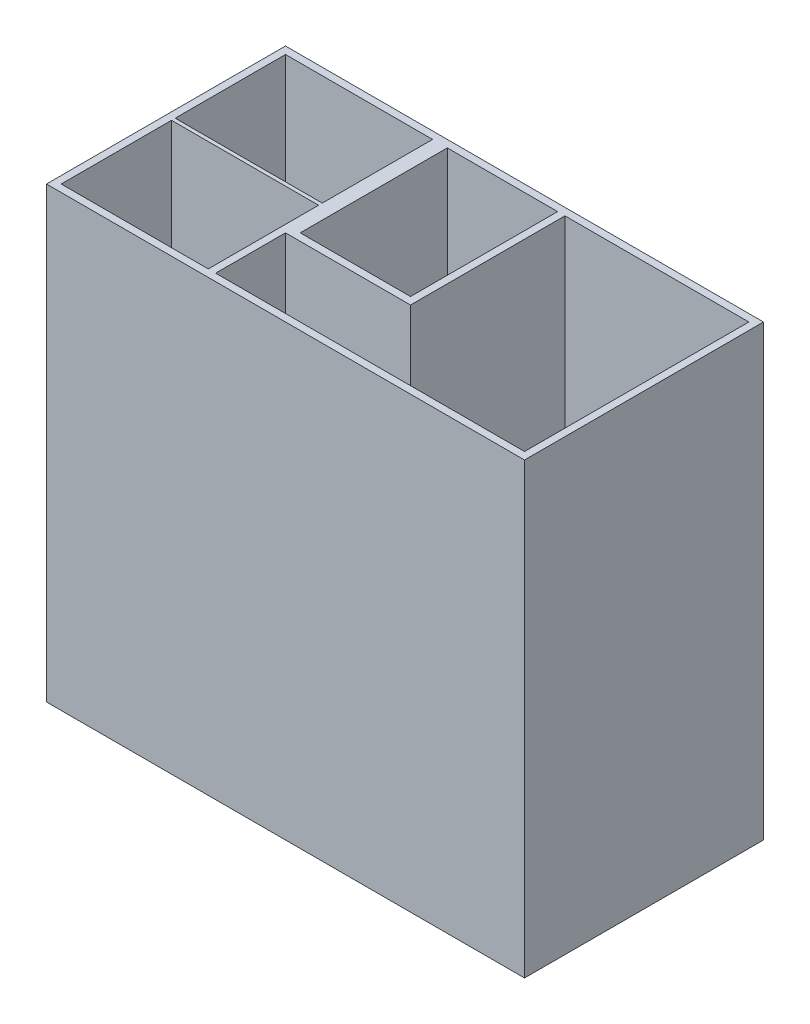
ISO-10303-21;
HEADER;
FILE_DESCRIPTION(('STEP AP214'),'2;1');
FILE_NAME('part.step','',(''),(''),'','','');
FILE_SCHEMA(('AUTOMOTIVE_DESIGN { 1 0 10303 214 1 1 1 1 }'));
ENDSEC;
DATA;
#1=APPLICATION_CONTEXT('core data for automotive mechanical design processes');
#2=APPLICATION_PROTOCOL_DEFINITION('international standard','automotive_design',2000,#1);
#3=PRODUCT_CONTEXT('',#1,'mechanical');
#4=PRODUCT('Part','Part','',(#3));
#5=PRODUCT_RELATED_PRODUCT_CATEGORY('part','',(#4));
#6=PRODUCT_DEFINITION_FORMATION('','',#4);
#7=PRODUCT_DEFINITION_CONTEXT('part definition',#1,'design');
#8=PRODUCT_DEFINITION('design','',#6,#7);
#9=PRODUCT_DEFINITION_SHAPE('','',#8);
#10=(LENGTH_UNIT() NAMED_UNIT(*) SI_UNIT(.MILLI.,.METRE.));
#11=(NAMED_UNIT(*) PLANE_ANGLE_UNIT() SI_UNIT($,.RADIAN.));
#12=(NAMED_UNIT(*) SI_UNIT($,.STERADIAN.) SOLID_ANGLE_UNIT());
#13=UNCERTAINTY_MEASURE_WITH_UNIT(LENGTH_MEASURE(1.E-05),#10,'distance_accuracy_value','');
#14=(GEOMETRIC_REPRESENTATION_CONTEXT(3) GLOBAL_UNCERTAINTY_ASSIGNED_CONTEXT((#13)) GLOBAL_UNIT_ASSIGNED_CONTEXT((#10,
#11,#12)) REPRESENTATION_CONTEXT('',''));
#15=CARTESIAN_POINT('',(0.,0.,0.));
#16=DIRECTION('',(0.,0.,1.));
#17=DIRECTION('',(1.,0.,0.));
#18=AXIS2_PLACEMENT_3D('',#15,#16,#17);
#19=CARTESIAN_POINT('',(-63.,122.,-30.5));
#20=DIRECTION('',(0.,0.,1.));
#21=DIRECTION('',(1.,0.,0.));
#22=AXIS2_PLACEMENT_3D('',#19,#20,#21);
#23=PLANE('',#22);
#24=DIRECTION('',(-1.,0.,0.));
#25=VECTOR('',#24,1.);
#26=CARTESIAN_POINT('',(-63.,2.,-30.5));
#27=LINE('',#26,#25);
#28=CARTESIAN_POINT('',(-23.,2.,-30.5));
#29=VERTEX_POINT('',#28);
#30=CARTESIAN_POINT('',(-63.,2.,-30.5));
#31=VERTEX_POINT('',#30);
#32=EDGE_CURVE('E295',#29,#31,#27,.T.);
#33=ORIENTED_EDGE('',*,*,#32,.F.);
#34=DIRECTION('',(0.,-1.,0.));
#35=VECTOR('',#34,1.);
#36=CARTESIAN_POINT('',(-23.,122.,-30.5));
#37=LINE('',#36,#35);
#38=CARTESIAN_POINT('',(-23.,122.,-30.5));
#39=VERTEX_POINT('',#38);
#40=EDGE_CURVE('E48',#39,#29,#37,.T.);
#41=ORIENTED_EDGE('',*,*,#40,.F.);
#42=DIRECTION('',(-1.,0.,0.));
#43=VECTOR('',#42,1.);
#44=CARTESIAN_POINT('',(-63.,122.,-30.5));
#45=LINE('',#44,#43);
#46=CARTESIAN_POINT('',(-63.,122.,-30.5));
#47=VERTEX_POINT('',#46);
#48=EDGE_CURVE('E191',#39,#47,#45,.T.);
#49=ORIENTED_EDGE('',*,*,#48,.T.);
#50=DIRECTION('',(0.,-1.,0.));
#51=VECTOR('',#50,1.);
#52=CARTESIAN_POINT('',(-63.,122.,-30.5));
#53=LINE('',#52,#51);
#54=EDGE_CURVE('E312',#47,#31,#53,.T.);
#55=ORIENTED_EDGE('',*,*,#54,.T.);
#56=EDGE_LOOP('',(#33,#41,#49,#55));
#57=FACE_BOUND('',#56,.T.);
#58=ADVANCED_FACE('F33',(#57),#23,.T.);
#59=DIRECTION('',(0.,-1.,0.));
#60=VECTOR('',#59,1.);
#61=CARTESIAN_POINT('',(-19.,122.,-30.5));
#62=LINE('',#61,#60);
#63=CARTESIAN_POINT('',(-19.,122.,-30.5));
#64=VERTEX_POINT('',#63);
#65=CARTESIAN_POINT('',(-19.,2.,-30.5));
#66=VERTEX_POINT('',#65);
#67=EDGE_CURVE('E279',#64,#66,#62,.T.);
#68=ORIENTED_EDGE('',*,*,#67,.T.);
#69=CARTESIAN_POINT('',(11.,2.,-30.5));
#70=VERTEX_POINT('',#69);
#71=EDGE_CURVE('E300',#70,#66,#27,.T.);
#72=ORIENTED_EDGE('',*,*,#71,.F.);
#73=DIRECTION('',(0.,-1.,0.));
#74=VECTOR('',#73,1.);
#75=CARTESIAN_POINT('',(11.,122.,-30.5));
#76=LINE('',#75,#74);
#77=CARTESIAN_POINT('',(11.,122.,-30.5));
#78=VERTEX_POINT('',#77);
#79=EDGE_CURVE('E255',#78,#70,#76,.T.);
#80=ORIENTED_EDGE('',*,*,#79,.F.);
#81=EDGE_CURVE('E56',#78,#64,#45,.T.);
#82=ORIENTED_EDGE('',*,*,#81,.T.);
#83=EDGE_LOOP('',(#68,#72,#80,#82));
#84=FACE_BOUND('',#83,.T.);
#85=ADVANCED_FACE('F371',(#84),#23,.T.);
#86=CARTESIAN_POINT('',(-63.,122.,-30.5));
#87=DIRECTION('',(1.,0.,0.));
#88=DIRECTION('',(0.,0.,-1.));
#89=AXIS2_PLACEMENT_3D('',#86,#87,#88);
#90=PLANE('',#89);
#91=DIRECTION('',(0.,0.,1.));
#92=VECTOR('',#91,1.);
#93=CARTESIAN_POINT('',(-63.,122.,-30.5));
#94=LINE('',#93,#92);
#95=CARTESIAN_POINT('',(-63.,122.,-0.49999999999998));
#96=VERTEX_POINT('',#95);
#97=EDGE_CURVE('E288',#47,#96,#94,.T.);
#98=ORIENTED_EDGE('',*,*,#97,.T.);
#99=DIRECTION('',(0.,-1.,0.));
#100=VECTOR('',#99,1.);
#101=CARTESIAN_POINT('',(-63.,122.,-0.499999999999982));
#102=LINE('',#101,#100);
#103=CARTESIAN_POINT('',(-63.,2.,-0.499999999999983));
#104=VERTEX_POINT('',#103);
#105=EDGE_CURVE('E202',#96,#104,#102,.T.);
#106=ORIENTED_EDGE('',*,*,#105,.T.);
#107=DIRECTION('',(0.,0.,1.));
#108=VECTOR('',#107,1.);
#109=CARTESIAN_POINT('',(-63.,2.,-30.5));
#110=LINE('',#109,#108);
#111=EDGE_CURVE('E301',#31,#104,#110,.T.);
#112=ORIENTED_EDGE('',*,*,#111,.F.);
#113=ORIENTED_EDGE('',*,*,#54,.F.);
#114=EDGE_LOOP('',(#98,#106,#112,#113));
#115=FACE_BOUND('',#114,.T.);
#116=ADVANCED_FACE('F377',(#115),#90,.T.);
#117=CARTESIAN_POINT('',(-63.,122.,30.5));
#118=DIRECTION('',(0.,0.,-1.));
#119=DIRECTION('',(-1.,0.,0.));
#120=AXIS2_PLACEMENT_3D('',#117,#118,#119);
#121=PLANE('',#120);
#122=DIRECTION('',(1.,0.,0.));
#123=VECTOR('',#122,1.);
#124=CARTESIAN_POINT('',(-63.,122.,30.5));
#125=LINE('',#124,#123);
#126=CARTESIAN_POINT('',(-63.,122.,30.5));
#127=VERTEX_POINT('',#126);
#128=CARTESIAN_POINT('',(-23.,122.,30.5));
#129=VERTEX_POINT('',#128);
#130=EDGE_CURVE('E291',#127,#129,#125,.T.);
#131=ORIENTED_EDGE('',*,*,#130,.T.);
#132=DIRECTION('',(0.,-1.,0.));
#133=VECTOR('',#132,1.);
#134=CARTESIAN_POINT('',(-23.,122.,30.5));
#135=LINE('',#134,#133);
#136=CARTESIAN_POINT('',(-23.,2.,30.5));
#137=VERTEX_POINT('',#136);
#138=EDGE_CURVE('E269',#129,#137,#135,.T.);
#139=ORIENTED_EDGE('',*,*,#138,.T.);
#140=DIRECTION('',(1.,0.,0.));
#141=VECTOR('',#140,1.);
#142=CARTESIAN_POINT('',(-63.,2.,30.5));
#143=LINE('',#142,#141);
#144=CARTESIAN_POINT('',(-63.,2.,30.5));
#145=VERTEX_POINT('',#144);
#146=EDGE_CURVE('E284',#145,#137,#143,.T.);
#147=ORIENTED_EDGE('',*,*,#146,.F.);
#148=DIRECTION('',(0.,-1.,0.));
#149=VECTOR('',#148,1.);
#150=CARTESIAN_POINT('',(-63.,122.,30.5));
#151=LINE('',#150,#149);
#152=EDGE_CURVE('E309',#127,#145,#151,.T.);
#153=ORIENTED_EDGE('',*,*,#152,.F.);
#154=EDGE_LOOP('',(#131,#139,#147,#153));
#155=FACE_BOUND('',#154,.T.);
#156=ADVANCED_FACE('F516',(#155),#121,.T.);
#157=CARTESIAN_POINT('',(-21.,2.,30.5));
#158=VERTEX_POINT('',#157);
#159=CARTESIAN_POINT('',(63.,2.,30.5));
#160=VERTEX_POINT('',#159);
#161=EDGE_CURVE('E304',#158,#160,#143,.T.);
#162=ORIENTED_EDGE('',*,*,#161,.F.);
#163=DIRECTION('',(0.,-1.,0.));
#164=VECTOR('',#163,1.);
#165=CARTESIAN_POINT('',(-21.,122.,30.5));
#166=LINE('',#165,#164);
#167=CARTESIAN_POINT('',(-21.,122.,30.5));
#168=VERTEX_POINT('',#167);
#169=EDGE_CURVE('E266',#168,#158,#166,.T.);
#170=ORIENTED_EDGE('',*,*,#169,.F.);
#171=CARTESIAN_POINT('',(63.,122.,30.5));
#172=VERTEX_POINT('',#171);
#173=EDGE_CURVE('E290',#168,#172,#125,.T.);
#174=ORIENTED_EDGE('',*,*,#173,.T.);
#175=DIRECTION('',(0.,-1.,0.));
#176=VECTOR('',#175,1.);
#177=CARTESIAN_POINT('',(63.,122.,30.5));
#178=LINE('',#177,#176);
#179=EDGE_CURVE('E293',#172,#160,#178,.T.);
#180=ORIENTED_EDGE('',*,*,#179,.T.);
#181=EDGE_LOOP('',(#162,#170,#174,#180));
#182=FACE_BOUND('',#181,.T.);
#183=ADVANCED_FACE('F410',(#182),#121,.T.);
#184=CARTESIAN_POINT('',(0.,2.,0.));
#185=DIRECTION('',(0.,1.,0.));
#186=DIRECTION('',(0.,0.,1.));
#187=AXIS2_PLACEMENT_3D('',#184,#185,#186);
#188=PLANE('',#187);
#189=DIRECTION('',(-1.,0.,0.));
#190=VECTOR('',#189,1.);
#191=CARTESIAN_POINT('',(0.,2.,-0.499999999999969));
#192=LINE('',#191,#190);
#193=CARTESIAN_POINT('',(-23.,2.,-0.499999999999976));
#194=VERTEX_POINT('',#193);
#195=EDGE_CURVE('E231',#194,#104,#192,.T.);
#196=ORIENTED_EDGE('',*,*,#195,.F.);
#197=DIRECTION('',(0.,0.,1.));
#198=VECTOR('',#197,1.);
#199=CARTESIAN_POINT('',(-23.,2.,0.));
#200=LINE('',#199,#198);
#201=EDGE_CURVE('E199',#29,#194,#200,.T.);
#202=ORIENTED_EDGE('',*,*,#201,.F.);
#203=ORIENTED_EDGE('',*,*,#32,.T.);
#204=ORIENTED_EDGE('',*,*,#111,.T.);
#205=EDGE_LOOP('',(#196,#202,#203,#204));
#206=FACE_BOUND('',#205,.T.);
#207=ADVANCED_FACE('F427',(#206),#188,.T.);
#208=DIRECTION('',(-1.,0.,0.));
#209=VECTOR('',#208,1.);
#210=CARTESIAN_POINT('',(0.,2.,11.5));
#211=LINE('',#210,#209);
#212=CARTESIAN_POINT('',(13.,2.,11.5));
#213=VERTEX_POINT('',#212);
#214=CARTESIAN_POINT('',(-21.,2.,11.5));
#215=VERTEX_POINT('',#214);
#216=EDGE_CURVE('E241',#213,#215,#211,.T.);
#217=ORIENTED_EDGE('',*,*,#216,.T.);
#218=DIRECTION('',(0.,0.,-1.));
#219=VECTOR('',#218,1.);
#220=CARTESIAN_POINT('',(-21.,2.,0.));
#221=LINE('',#220,#219);
#222=EDGE_CURVE('E238',#158,#215,#221,.T.);
#223=ORIENTED_EDGE('',*,*,#222,.F.);
#224=ORIENTED_EDGE('',*,*,#161,.T.);
#225=DIRECTION('',(0.,0.,-1.));
#226=VECTOR('',#225,1.);
#227=CARTESIAN_POINT('',(63.,2.,-30.5));
#228=LINE('',#227,#226);
#229=CARTESIAN_POINT('',(63.,2.,-30.5));
#230=VERTEX_POINT('',#229);
#231=EDGE_CURVE('E281',#160,#230,#228,.T.);
#232=ORIENTED_EDGE('',*,*,#231,.T.);
#233=CARTESIAN_POINT('',(13.,2.,-30.5));
#234=VERTEX_POINT('',#233);
#235=EDGE_CURVE('E296',#230,#234,#27,.T.);
#236=ORIENTED_EDGE('',*,*,#235,.T.);
#237=DIRECTION('',(0.,0.,1.));
#238=VECTOR('',#237,1.);
#239=CARTESIAN_POINT('',(13.,2.,0.));
#240=LINE('',#239,#238);
#241=EDGE_CURVE('E243',#234,#213,#240,.T.);
#242=ORIENTED_EDGE('',*,*,#241,.T.);
#243=EDGE_LOOP('',(#217,#223,#224,#232,#236,#242));
#244=FACE_BOUND('',#243,.T.);
#245=ADVANCED_FACE('F399',(#244),#188,.T.);
#246=DIRECTION('',(-1.,0.,0.));
#247=VECTOR('',#246,1.);
#248=CARTESIAN_POINT('',(0.,2.,0.499999999999987));
#249=LINE('',#248,#247);
#250=CARTESIAN_POINT('',(-23.,2.,0.499999999999987));
#251=VERTEX_POINT('',#250);
#252=CARTESIAN_POINT('',(-63.,2.,0.499999999999987));
#253=VERTEX_POINT('',#252);
#254=EDGE_CURVE('E233',#251,#253,#249,.T.);
#255=ORIENTED_EDGE('',*,*,#254,.T.);
#256=EDGE_CURVE('E299',#253,#145,#110,.T.);
#257=ORIENTED_EDGE('',*,*,#256,.T.);
#258=ORIENTED_EDGE('',*,*,#146,.T.);
#259=DIRECTION('',(0.,0.,1.));
#260=VECTOR('',#259,1.);
#261=CARTESIAN_POINT('',(-23.,2.,0.));
#262=LINE('',#261,#260);
#263=EDGE_CURVE('E235',#251,#137,#262,.T.);
#264=ORIENTED_EDGE('',*,*,#263,.F.);
#265=EDGE_LOOP('',(#255,#257,#258,#264));
#266=FACE_BOUND('',#265,.T.);
#267=ADVANCED_FACE('F369',(#266),#188,.T.);
#268=CARTESIAN_POINT('',(65.,2.,-32.5));
#269=DIRECTION('',(-1.,0.,0.));
#270=DIRECTION('',(0.,0.,1.));
#271=AXIS2_PLACEMENT_3D('',#268,#269,#270);
#272=PLANE('',#271);
#273=DIRECTION('',(0.,0.,-1.));
#274=VECTOR('',#273,1.);
#275=CARTESIAN_POINT('',(65.,0.,-32.5));
#276=LINE('',#275,#274);
#277=CARTESIAN_POINT('',(65.,0.,32.5));
#278=VERTEX_POINT('',#277);
#279=CARTESIAN_POINT('',(65.,0.,-32.5));
#280=VERTEX_POINT('',#279);
#281=EDGE_CURVE('E330',#278,#280,#276,.T.);
#282=ORIENTED_EDGE('',*,*,#281,.T.);
#283=DIRECTION('',(0.,-1.,0.));
#284=VECTOR('',#283,1.);
#285=CARTESIAN_POINT('',(65.,2.,-32.5));
#286=LINE('',#285,#284);
#287=CARTESIAN_POINT('',(65.,122.,-32.5));
#288=VERTEX_POINT('',#287);
#289=EDGE_CURVE('E11',#288,#280,#286,.T.);
#290=ORIENTED_EDGE('',*,*,#289,.F.);
#291=DIRECTION('',(0.,0.,-1.));
#292=VECTOR('',#291,1.);
#293=CARTESIAN_POINT('',(65.,122.,-32.5));
#294=LINE('',#293,#292);
#295=CARTESIAN_POINT('',(65.,122.,32.5));
#296=VERTEX_POINT('',#295);
#297=EDGE_CURVE('E318',#296,#288,#294,.T.);
#298=ORIENTED_EDGE('',*,*,#297,.F.);
#299=DIRECTION('',(0.,-1.,0.));
#300=VECTOR('',#299,1.);
#301=CARTESIAN_POINT('',(65.,2.,32.5));
#302=LINE('',#301,#300);
#303=EDGE_CURVE('E339',#296,#278,#302,.T.);
#304=ORIENTED_EDGE('',*,*,#303,.T.);
#305=EDGE_LOOP('',(#282,#290,#298,#304));
#306=FACE_BOUND('',#305,.T.);
#307=ADVANCED_FACE('F35',(#306),#272,.F.);
#308=CARTESIAN_POINT('',(-65.,2.,-32.5));
#309=DIRECTION('',(0.,0.,1.));
#310=DIRECTION('',(1.,0.,0.));
#311=AXIS2_PLACEMENT_3D('',#308,#309,#310);
#312=PLANE('',#311);
#313=DIRECTION('',(-1.,0.,0.));
#314=VECTOR('',#313,1.);
#315=CARTESIAN_POINT('',(-65.,0.,-32.5));
#316=LINE('',#315,#314);
#317=CARTESIAN_POINT('',(-65.,0.,-32.5));
#318=VERTEX_POINT('',#317);
#319=EDGE_CURVE('E333',#280,#318,#316,.T.);
#320=ORIENTED_EDGE('',*,*,#319,.T.);
#321=DIRECTION('',(0.,-1.,0.));
#322=VECTOR('',#321,1.);
#323=CARTESIAN_POINT('',(-65.,2.,-32.5));
#324=LINE('',#323,#322);
#325=CARTESIAN_POINT('',(-65.,122.,-32.5));
#326=VERTEX_POINT('',#325);
#327=EDGE_CURVE('E41',#326,#318,#324,.T.);
#328=ORIENTED_EDGE('',*,*,#327,.F.);
#329=DIRECTION('',(-1.,0.,0.));
#330=VECTOR('',#329,1.);
#331=CARTESIAN_POINT('',(-65.,122.,-32.5));
#332=LINE('',#331,#330);
#333=EDGE_CURVE('E321',#288,#326,#332,.T.);
#334=ORIENTED_EDGE('',*,*,#333,.F.);
#335=ORIENTED_EDGE('',*,*,#289,.T.);
#336=EDGE_LOOP('',(#320,#328,#334,#335));
#337=FACE_BOUND('',#336,.T.);
#338=ADVANCED_FACE('F362',(#337),#312,.F.);
#339=CARTESIAN_POINT('',(-65.,2.,-32.5));
#340=DIRECTION('',(1.,0.,0.));
#341=DIRECTION('',(0.,0.,-1.));
#342=AXIS2_PLACEMENT_3D('',#339,#340,#341);
#343=PLANE('',#342);
#344=DIRECTION('',(0.,0.,1.));
#345=VECTOR('',#344,1.);
#346=CARTESIAN_POINT('',(-65.,0.,-32.5));
#347=LINE('',#346,#345);
#348=CARTESIAN_POINT('',(-65.,0.,32.5));
#349=VERTEX_POINT('',#348);
#350=EDGE_CURVE('E335',#318,#349,#347,.T.);
#351=ORIENTED_EDGE('',*,*,#350,.T.);
#352=DIRECTION('',(0.,-1.,0.));
#353=VECTOR('',#352,1.);
#354=CARTESIAN_POINT('',(-65.,2.,32.5));
#355=LINE('',#354,#353);
#356=CARTESIAN_POINT('',(-65.,122.,32.5));
#357=VERTEX_POINT('',#356);
#358=EDGE_CURVE('E342',#357,#349,#355,.T.);
#359=ORIENTED_EDGE('',*,*,#358,.F.);
#360=DIRECTION('',(0.,0.,1.));
#361=VECTOR('',#360,1.);
#362=CARTESIAN_POINT('',(-65.,122.,-32.5));
#363=LINE('',#362,#361);
#364=EDGE_CURVE('E324',#326,#357,#363,.T.);
#365=ORIENTED_EDGE('',*,*,#364,.F.);
#366=ORIENTED_EDGE('',*,*,#327,.T.);
#367=EDGE_LOOP('',(#351,#359,#365,#366));
#368=FACE_BOUND('',#367,.T.);
#369=ADVANCED_FACE('F348',(#368),#343,.F.);
#370=CARTESIAN_POINT('',(-65.,2.,32.5));
#371=DIRECTION('',(0.,0.,-1.));
#372=DIRECTION('',(-1.,0.,0.));
#373=AXIS2_PLACEMENT_3D('',#370,#371,#372);
#374=PLANE('',#373);
#375=DIRECTION('',(1.,0.,0.));
#376=VECTOR('',#375,1.);
#377=CARTESIAN_POINT('',(-65.,0.,32.5));
#378=LINE('',#377,#376);
#379=EDGE_CURVE('E337',#349,#278,#378,.T.);
#380=ORIENTED_EDGE('',*,*,#379,.T.);
#381=ORIENTED_EDGE('',*,*,#303,.F.);
#382=DIRECTION('',(1.,0.,0.));
#383=VECTOR('',#382,1.);
#384=CARTESIAN_POINT('',(-65.,122.,32.5));
#385=LINE('',#384,#383);
#386=EDGE_CURVE('E327',#357,#296,#385,.T.);
#387=ORIENTED_EDGE('',*,*,#386,.F.);
#388=ORIENTED_EDGE('',*,*,#358,.T.);
#389=EDGE_LOOP('',(#380,#381,#387,#388));
#390=FACE_BOUND('',#389,.T.);
#391=ADVANCED_FACE('F356',(#390),#374,.F.);
#392=CARTESIAN_POINT('',(0.,0.,0.));
#393=DIRECTION('',(0.,1.,0.));
#394=DIRECTION('',(0.,0.,1.));
#395=AXIS2_PLACEMENT_3D('',#392,#393,#394);
#396=PLANE('',#395);
#397=ORIENTED_EDGE('',*,*,#281,.F.);
#398=ORIENTED_EDGE('',*,*,#379,.F.);
#399=ORIENTED_EDGE('',*,*,#350,.F.);
#400=ORIENTED_EDGE('',*,*,#319,.F.);
#401=EDGE_LOOP('',(#397,#398,#399,#400));
#402=FACE_BOUND('',#401,.T.);
#403=ADVANCED_FACE('F354',(#402),#396,.F.);
#404=CARTESIAN_POINT('',(0.,122.,0.));
#405=DIRECTION('',(0.,1.,0.));
#406=DIRECTION('',(0.,0.,1.));
#407=AXIS2_PLACEMENT_3D('',#404,#405,#406);
#408=PLANE('',#407);
#409=ORIENTED_EDGE('',*,*,#81,.F.);
#410=DIRECTION('',(0.,0.,1.));
#411=VECTOR('',#410,1.);
#412=CARTESIAN_POINT('',(11.,122.,0.));
#413=LINE('',#412,#411);
#414=CARTESIAN_POINT('',(11.,122.,9.5));
#415=VERTEX_POINT('',#414);
#416=EDGE_CURVE('E222',#78,#415,#413,.T.);
#417=ORIENTED_EDGE('',*,*,#416,.T.);
#418=DIRECTION('',(1.,0.,0.));
#419=VECTOR('',#418,1.);
#420=CARTESIAN_POINT('',(0.,122.,9.50000000000005));
#421=LINE('',#420,#419);
#422=CARTESIAN_POINT('',(-19.,122.,9.50000000000007));
#423=VERTEX_POINT('',#422);
#424=EDGE_CURVE('E224',#423,#415,#421,.T.);
#425=ORIENTED_EDGE('',*,*,#424,.F.);
#426=DIRECTION('',(0.,0.,1.));
#427=VECTOR('',#426,1.);
#428=CARTESIAN_POINT('',(-19.,122.,0.));
#429=LINE('',#428,#427);
#430=EDGE_CURVE('E193',#64,#423,#429,.T.);
#431=ORIENTED_EDGE('',*,*,#430,.F.);
#432=EDGE_LOOP('',(#409,#417,#425,#431));
#433=FACE_BOUND('',#432,.T.);
#434=ORIENTED_EDGE('',*,*,#48,.F.);
#435=DIRECTION('',(0.,0.,1.));
#436=VECTOR('',#435,1.);
#437=CARTESIAN_POINT('',(-23.,122.,0.));
#438=LINE('',#437,#436);
#439=CARTESIAN_POINT('',(-23.,122.,-0.499999999999976));
#440=VERTEX_POINT('',#439);
#441=EDGE_CURVE('E183',#39,#440,#438,.T.);
#442=ORIENTED_EDGE('',*,*,#441,.T.);
#443=DIRECTION('',(-1.,0.,0.));
#444=VECTOR('',#443,1.);
#445=CARTESIAN_POINT('',(0.,122.,-0.499999999999969));
#446=LINE('',#445,#444);
#447=EDGE_CURVE('E189',#440,#96,#446,.T.);
#448=ORIENTED_EDGE('',*,*,#447,.T.);
#449=ORIENTED_EDGE('',*,*,#97,.F.);
#450=EDGE_LOOP('',(#434,#442,#448,#449));
#451=FACE_BOUND('',#450,.T.);
#452=CARTESIAN_POINT('',(-63.,122.,0.499999999999987));
#453=VERTEX_POINT('',#452);
#454=EDGE_CURVE('E287',#453,#127,#94,.T.);
#455=ORIENTED_EDGE('',*,*,#454,.F.);
#456=DIRECTION('',(-1.,0.,0.));
#457=VECTOR('',#456,1.);
#458=CARTESIAN_POINT('',(0.,122.,0.499999999999987));
#459=LINE('',#458,#457);
#460=CARTESIAN_POINT('',(-23.,122.,0.499999999999987));
#461=VERTEX_POINT('',#460);
#462=EDGE_CURVE('E205',#461,#453,#459,.T.);
#463=ORIENTED_EDGE('',*,*,#462,.F.);
#464=DIRECTION('',(0.,0.,1.));
#465=VECTOR('',#464,1.);
#466=CARTESIAN_POINT('',(-23.,122.,0.));
#467=LINE('',#466,#465);
#468=EDGE_CURVE('E208',#461,#129,#467,.T.);
#469=ORIENTED_EDGE('',*,*,#468,.T.);
#470=ORIENTED_EDGE('',*,*,#130,.F.);
#471=EDGE_LOOP('',(#455,#463,#469,#470));
#472=FACE_BOUND('',#471,.T.);
#473=ORIENTED_EDGE('',*,*,#297,.T.);
#474=ORIENTED_EDGE('',*,*,#333,.T.);
#475=ORIENTED_EDGE('',*,*,#364,.T.);
#476=ORIENTED_EDGE('',*,*,#386,.T.);
#477=EDGE_LOOP('',(#473,#474,#475,#476));
#478=FACE_BOUND('',#477,.T.);
#479=CARTESIAN_POINT('',(63.,122.,-30.5));
#480=VERTEX_POINT('',#479);
#481=CARTESIAN_POINT('',(13.,122.,-30.5));
#482=VERTEX_POINT('',#481);
#483=EDGE_CURVE('E285',#480,#482,#45,.T.);
#484=ORIENTED_EDGE('',*,*,#483,.F.);
#485=DIRECTION('',(0.,0.,-1.));
#486=VECTOR('',#485,1.);
#487=CARTESIAN_POINT('',(63.,122.,-30.5));
#488=LINE('',#487,#486);
#489=EDGE_CURVE('E282',#172,#480,#488,.T.);
#490=ORIENTED_EDGE('',*,*,#489,.F.);
#491=ORIENTED_EDGE('',*,*,#173,.F.);
#492=DIRECTION('',(0.,0.,-1.));
#493=VECTOR('',#492,1.);
#494=CARTESIAN_POINT('',(-21.,122.,0.));
#495=LINE('',#494,#493);
#496=CARTESIAN_POINT('',(-21.,122.,11.5));
#497=VERTEX_POINT('',#496);
#498=EDGE_CURVE('E214',#168,#497,#495,.T.);
#499=ORIENTED_EDGE('',*,*,#498,.T.);
#500=DIRECTION('',(-1.,0.,0.));
#501=VECTOR('',#500,1.);
#502=CARTESIAN_POINT('',(0.,122.,11.5));
#503=LINE('',#502,#501);
#504=CARTESIAN_POINT('',(13.,122.,11.5));
#505=VERTEX_POINT('',#504);
#506=EDGE_CURVE('E216',#505,#497,#503,.T.);
#507=ORIENTED_EDGE('',*,*,#506,.F.);
#508=DIRECTION('',(0.,0.,1.));
#509=VECTOR('',#508,1.);
#510=CARTESIAN_POINT('',(13.,122.,0.));
#511=LINE('',#510,#509);
#512=EDGE_CURVE('E219',#482,#505,#511,.T.);
#513=ORIENTED_EDGE('',*,*,#512,.F.);
#514=EDGE_LOOP('',(#484,#490,#491,#499,#507,#513));
#515=FACE_BOUND('',#514,.T.);
#516=ADVANCED_FACE('F185',(#433,#451,#472,#478,#515),#408,.T.);
#517=CARTESIAN_POINT('',(63.,122.,-30.5));
#518=DIRECTION('',(-1.,0.,0.));
#519=DIRECTION('',(0.,0.,1.));
#520=AXIS2_PLACEMENT_3D('',#517,#518,#519);
#521=PLANE('',#520);
#522=ORIENTED_EDGE('',*,*,#231,.F.);
#523=ORIENTED_EDGE('',*,*,#179,.F.);
#524=ORIENTED_EDGE('',*,*,#489,.T.);
#525=DIRECTION('',(0.,-1.,0.));
#526=VECTOR('',#525,1.);
#527=CARTESIAN_POINT('',(63.,122.,-30.5));
#528=LINE('',#527,#526);
#529=EDGE_CURVE('E315',#480,#230,#528,.T.);
#530=ORIENTED_EDGE('',*,*,#529,.T.);
#531=EDGE_LOOP('',(#522,#523,#524,#530));
#532=FACE_BOUND('',#531,.T.);
#533=ADVANCED_FACE('F382',(#532),#521,.T.);
#534=DIRECTION('',(0.,-1.,0.));
#535=VECTOR('',#534,1.);
#536=CARTESIAN_POINT('',(13.,122.,-30.5));
#537=LINE('',#536,#535);
#538=EDGE_CURVE('E258',#482,#234,#537,.T.);
#539=ORIENTED_EDGE('',*,*,#538,.T.);
#540=ORIENTED_EDGE('',*,*,#235,.F.);
#541=ORIENTED_EDGE('',*,*,#529,.F.);
#542=ORIENTED_EDGE('',*,*,#483,.T.);
#543=EDGE_LOOP('',(#539,#540,#541,#542));
#544=FACE_BOUND('',#543,.T.);
#545=ADVANCED_FACE('F373',(#544),#23,.T.);
#546=DIRECTION('',(0.,-1.,0.));
#547=VECTOR('',#546,1.);
#548=CARTESIAN_POINT('',(-63.,122.,0.499999999999987));
#549=LINE('',#548,#547);
#550=EDGE_CURVE('E274',#453,#253,#549,.T.);
#551=ORIENTED_EDGE('',*,*,#550,.F.);
#552=ORIENTED_EDGE('',*,*,#454,.T.);
#553=ORIENTED_EDGE('',*,*,#152,.T.);
#554=ORIENTED_EDGE('',*,*,#256,.F.);
#555=EDGE_LOOP('',(#551,#552,#553,#554));
#556=FACE_BOUND('',#555,.T.);
#557=ADVANCED_FACE('F381',(#556),#90,.T.);
#558=DIRECTION('',(0.,0.,1.));
#559=VECTOR('',#558,1.);
#560=CARTESIAN_POINT('',(-19.,2.,0.));
#561=LINE('',#560,#559);
#562=CARTESIAN_POINT('',(-19.,2.,9.50000000000007));
#563=VERTEX_POINT('',#562);
#564=EDGE_CURVE('E228',#66,#563,#561,.T.);
#565=ORIENTED_EDGE('',*,*,#564,.T.);
#566=DIRECTION('',(1.,0.,0.));
#567=VECTOR('',#566,1.);
#568=CARTESIAN_POINT('',(0.,2.,9.50000000000005));
#569=LINE('',#568,#567);
#570=CARTESIAN_POINT('',(11.,2.,9.5));
#571=VERTEX_POINT('',#570);
#572=EDGE_CURVE('E248',#563,#571,#569,.T.);
#573=ORIENTED_EDGE('',*,*,#572,.T.);
#574=DIRECTION('',(0.,0.,1.));
#575=VECTOR('',#574,1.);
#576=CARTESIAN_POINT('',(11.,2.,0.));
#577=LINE('',#576,#575);
#578=EDGE_CURVE('E245',#70,#571,#577,.T.);
#579=ORIENTED_EDGE('',*,*,#578,.F.);
#580=ORIENTED_EDGE('',*,*,#71,.T.);
#581=EDGE_LOOP('',(#565,#573,#579,#580));
#582=FACE_BOUND('',#581,.T.);
#583=ADVANCED_FACE('F388',(#582),#188,.T.);
#584=CARTESIAN_POINT('',(-19.,122.,0.));
#585=DIRECTION('',(1.,0.,0.));
#586=DIRECTION('',(0.,0.,-1.));
#587=AXIS2_PLACEMENT_3D('',#584,#585,#586);
#588=PLANE('',#587);
#589=ORIENTED_EDGE('',*,*,#564,.F.);
#590=ORIENTED_EDGE('',*,*,#67,.F.);
#591=ORIENTED_EDGE('',*,*,#430,.T.);
#592=DIRECTION('',(0.,-1.,0.));
#593=VECTOR('',#592,1.);
#594=CARTESIAN_POINT('',(-19.,122.,9.50000000000007));
#595=LINE('',#594,#593);
#596=EDGE_CURVE('E227',#423,#563,#595,.T.);
#597=ORIENTED_EDGE('',*,*,#596,.T.);
#598=EDGE_LOOP('',(#589,#590,#591,#597));
#599=FACE_BOUND('',#598,.T.);
#600=ADVANCED_FACE('F425',(#599),#588,.T.);
#601=CARTESIAN_POINT('',(-23.,122.,0.));
#602=DIRECTION('',(1.,0.,0.));
#603=DIRECTION('',(0.,0.,-1.));
#604=AXIS2_PLACEMENT_3D('',#601,#602,#603);
#605=PLANE('',#604);
#606=ORIENTED_EDGE('',*,*,#201,.T.);
#607=DIRECTION('',(0.,-1.,0.));
#608=VECTOR('',#607,1.);
#609=CARTESIAN_POINT('',(-23.,122.,-0.499999999999976));
#610=LINE('',#609,#608);
#611=EDGE_CURVE('E197',#440,#194,#610,.T.);
#612=ORIENTED_EDGE('',*,*,#611,.F.);
#613=ORIENTED_EDGE('',*,*,#441,.F.);
#614=ORIENTED_EDGE('',*,*,#40,.T.);
#615=EDGE_LOOP('',(#606,#612,#613,#614));
#616=FACE_BOUND('',#615,.T.);
#617=ADVANCED_FACE('F198',(#616),#605,.F.);
#618=CARTESIAN_POINT('',(0.,122.,-0.499999999999969));
#619=DIRECTION('',(0.,0.,1.));
#620=DIRECTION('',(1.,0.,0.));
#621=AXIS2_PLACEMENT_3D('',#618,#619,#620);
#622=PLANE('',#621);
#623=ORIENTED_EDGE('',*,*,#195,.T.);
#624=ORIENTED_EDGE('',*,*,#105,.F.);
#625=ORIENTED_EDGE('',*,*,#447,.F.);
#626=ORIENTED_EDGE('',*,*,#611,.T.);
#627=EDGE_LOOP('',(#623,#624,#625,#626));
#628=FACE_BOUND('',#627,.T.);
#629=ADVANCED_FACE('F204',(#628),#622,.F.);
#630=CARTESIAN_POINT('',(0.,122.,0.499999999999987));
#631=DIRECTION('',(0.,0.,1.));
#632=DIRECTION('',(1.,0.,0.));
#633=AXIS2_PLACEMENT_3D('',#630,#631,#632);
#634=PLANE('',#633);
#635=ORIENTED_EDGE('',*,*,#254,.F.);
#636=DIRECTION('',(0.,-1.,0.));
#637=VECTOR('',#636,1.);
#638=CARTESIAN_POINT('',(-23.,122.,0.499999999999987));
#639=LINE('',#638,#637);
#640=EDGE_CURVE('E271',#461,#251,#639,.T.);
#641=ORIENTED_EDGE('',*,*,#640,.F.);
#642=ORIENTED_EDGE('',*,*,#462,.T.);
#643=ORIENTED_EDGE('',*,*,#550,.T.);
#644=EDGE_LOOP('',(#635,#641,#642,#643));
#645=FACE_BOUND('',#644,.T.);
#646=ADVANCED_FACE('F555',(#645),#634,.T.);
#647=CARTESIAN_POINT('',(-23.,122.,0.));
#648=DIRECTION('',(1.,0.,0.));
#649=DIRECTION('',(0.,0.,-1.));
#650=AXIS2_PLACEMENT_3D('',#647,#648,#649);
#651=PLANE('',#650);
#652=ORIENTED_EDGE('',*,*,#263,.T.);
#653=ORIENTED_EDGE('',*,*,#138,.F.);
#654=ORIENTED_EDGE('',*,*,#468,.F.);
#655=ORIENTED_EDGE('',*,*,#640,.T.);
#656=EDGE_LOOP('',(#652,#653,#654,#655));
#657=FACE_BOUND('',#656,.T.);
#658=ADVANCED_FACE('F558',(#657),#651,.F.);
#659=CARTESIAN_POINT('',(-21.,122.,0.));
#660=DIRECTION('',(-1.,0.,0.));
#661=DIRECTION('',(0.,0.,1.));
#662=AXIS2_PLACEMENT_3D('',#659,#660,#661);
#663=PLANE('',#662);
#664=ORIENTED_EDGE('',*,*,#222,.T.);
#665=DIRECTION('',(0.,-1.,0.));
#666=VECTOR('',#665,1.);
#667=CARTESIAN_POINT('',(-21.,122.,11.5));
#668=LINE('',#667,#666);
#669=EDGE_CURVE('E263',#497,#215,#668,.T.);
#670=ORIENTED_EDGE('',*,*,#669,.F.);
#671=ORIENTED_EDGE('',*,*,#498,.F.);
#672=ORIENTED_EDGE('',*,*,#169,.T.);
#673=EDGE_LOOP('',(#664,#670,#671,#672));
#674=FACE_BOUND('',#673,.T.);
#675=ADVANCED_FACE('F414',(#674),#663,.F.);
#676=CARTESIAN_POINT('',(0.,122.,11.5));
#677=DIRECTION('',(0.,0.,1.));
#678=DIRECTION('',(1.,0.,0.));
#679=AXIS2_PLACEMENT_3D('',#676,#677,#678);
#680=PLANE('',#679);
#681=ORIENTED_EDGE('',*,*,#216,.F.);
#682=DIRECTION('',(0.,-1.,0.));
#683=VECTOR('',#682,1.);
#684=CARTESIAN_POINT('',(13.,122.,11.5));
#685=LINE('',#684,#683);
#686=EDGE_CURVE('E260',#505,#213,#685,.T.);
#687=ORIENTED_EDGE('',*,*,#686,.F.);
#688=ORIENTED_EDGE('',*,*,#506,.T.);
#689=ORIENTED_EDGE('',*,*,#669,.T.);
#690=EDGE_LOOP('',(#681,#687,#688,#689));
#691=FACE_BOUND('',#690,.T.);
#692=ADVANCED_FACE('F405',(#691),#680,.T.);
#693=CARTESIAN_POINT('',(13.,122.,0.));
#694=DIRECTION('',(1.,0.,0.));
#695=DIRECTION('',(0.,0.,-1.));
#696=AXIS2_PLACEMENT_3D('',#693,#694,#695);
#697=PLANE('',#696);
#698=ORIENTED_EDGE('',*,*,#241,.F.);
#699=ORIENTED_EDGE('',*,*,#538,.F.);
#700=ORIENTED_EDGE('',*,*,#512,.T.);
#701=ORIENTED_EDGE('',*,*,#686,.T.);
#702=EDGE_LOOP('',(#698,#699,#700,#701));
#703=FACE_BOUND('',#702,.T.);
#704=ADVANCED_FACE('F401',(#703),#697,.T.);
#705=CARTESIAN_POINT('',(11.,122.,0.));
#706=DIRECTION('',(1.,0.,0.));
#707=DIRECTION('',(0.,0.,-1.));
#708=AXIS2_PLACEMENT_3D('',#705,#706,#707);
#709=PLANE('',#708);
#710=ORIENTED_EDGE('',*,*,#578,.T.);
#711=DIRECTION('',(0.,-1.,0.));
#712=VECTOR('',#711,1.);
#713=CARTESIAN_POINT('',(11.,122.,9.5));
#714=LINE('',#713,#712);
#715=EDGE_CURVE('E252',#415,#571,#714,.T.);
#716=ORIENTED_EDGE('',*,*,#715,.F.);
#717=ORIENTED_EDGE('',*,*,#416,.F.);
#718=ORIENTED_EDGE('',*,*,#79,.T.);
#719=EDGE_LOOP('',(#710,#716,#717,#718));
#720=FACE_BOUND('',#719,.T.);
#721=ADVANCED_FACE('F569',(#720),#709,.F.);
#722=CARTESIAN_POINT('',(0.,122.,9.50000000000005));
#723=DIRECTION('',(0.,0.,-1.));
#724=DIRECTION('',(-1.,0.,0.));
#725=AXIS2_PLACEMENT_3D('',#722,#723,#724);
#726=PLANE('',#725);
#727=ORIENTED_EDGE('',*,*,#572,.F.);
#728=ORIENTED_EDGE('',*,*,#596,.F.);
#729=ORIENTED_EDGE('',*,*,#424,.T.);
#730=ORIENTED_EDGE('',*,*,#715,.T.);
#731=EDGE_LOOP('',(#727,#728,#729,#730));
#732=FACE_BOUND('',#731,.T.);
#733=ADVANCED_FACE('F572',(#732),#726,.T.);
#734=CLOSED_SHELL('',(#58,#85,#116,#156,#183,#207,#245,#267,#307,#338,#369,#391,#403,#516,#533,
#545,#557,#583,#600,#617,#629,#646,#658,#675,#692,#704,#721,#733));
#735=MANIFOLD_SOLID_BREP('B2',#734);
#736=ADVANCED_BREP_SHAPE_REPRESENTATION('',(#18,#735),#14);
#737=SHAPE_DEFINITION_REPRESENTATION(#9,#736);
ENDSEC;
END-ISO-10303-21;
